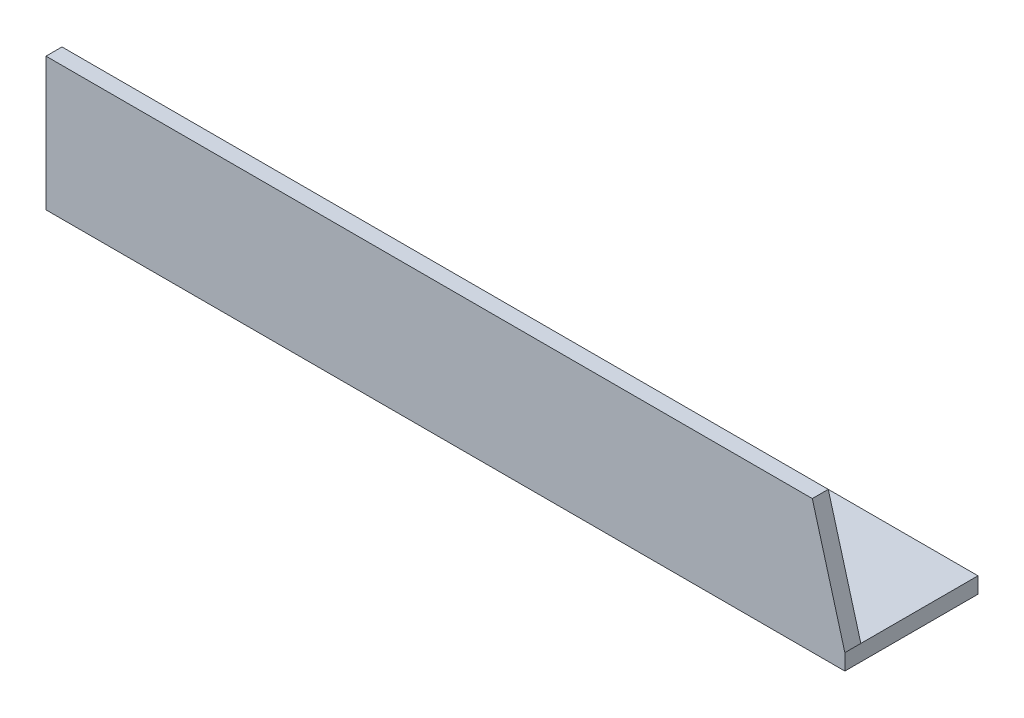
ISO-10303-21;
HEADER;
FILE_DESCRIPTION(('STEP AP214'),'2;1');
FILE_NAME('part.step','',(''),(''),'','','');
FILE_SCHEMA(('AUTOMOTIVE_DESIGN { 1 0 10303 214 1 1 1 1 }'));
ENDSEC;
DATA;
#1=APPLICATION_CONTEXT('core data for automotive mechanical design processes');
#2=APPLICATION_PROTOCOL_DEFINITION('international standard','automotive_design',2000,#1);
#3=PRODUCT_CONTEXT('',#1,'mechanical');
#4=PRODUCT('Part','Part','',(#3));
#5=PRODUCT_RELATED_PRODUCT_CATEGORY('part','',(#4));
#6=PRODUCT_DEFINITION_FORMATION('','',#4);
#7=PRODUCT_DEFINITION_CONTEXT('part definition',#1,'design');
#8=PRODUCT_DEFINITION('design','',#6,#7);
#9=PRODUCT_DEFINITION_SHAPE('','',#8);
#10=(LENGTH_UNIT() NAMED_UNIT(*) SI_UNIT(.MILLI.,.METRE.));
#11=(NAMED_UNIT(*) PLANE_ANGLE_UNIT() SI_UNIT($,.RADIAN.));
#12=(NAMED_UNIT(*) SI_UNIT($,.STERADIAN.) SOLID_ANGLE_UNIT());
#13=UNCERTAINTY_MEASURE_WITH_UNIT(LENGTH_MEASURE(1.E-05),#10,'distance_accuracy_value','');
#14=(GEOMETRIC_REPRESENTATION_CONTEXT(3) GLOBAL_UNCERTAINTY_ASSIGNED_CONTEXT((#13)) GLOBAL_UNIT_ASSIGNED_CONTEXT((#10,
#11,#12)) REPRESENTATION_CONTEXT('',''));
#15=CARTESIAN_POINT('',(0.,0.,0.));
#16=DIRECTION('',(0.,0.,1.));
#17=DIRECTION('',(1.,0.,0.));
#18=AXIS2_PLACEMENT_3D('',#15,#16,#17);
#19=CARTESIAN_POINT('',(300.,0.,0.));
#20=DIRECTION('',(0.,1.,0.));
#21=DIRECTION('',(0.,0.,1.));
#22=AXIS2_PLACEMENT_3D('',#19,#20,#21);
#23=PLANE('',#22);
#24=DIRECTION('',(0.,0.,-1.));
#25=VECTOR('',#24,1.);
#26=CARTESIAN_POINT('',(0.,0.,0.));
#27=LINE('',#26,#25);
#28=CARTESIAN_POINT('',(0.,0.,0.));
#29=VERTEX_POINT('',#28);
#30=CARTESIAN_POINT('',(0.,0.,-50.));
#31=VERTEX_POINT('',#30);
#32=EDGE_CURVE('E130',#29,#31,#27,.T.);
#33=ORIENTED_EDGE('',*,*,#32,.T.);
#34=DIRECTION('',(-1.,0.,0.));
#35=VECTOR('',#34,1.);
#36=CARTESIAN_POINT('',(300.,0.,-50.));
#37=LINE('',#36,#35);
#38=CARTESIAN_POINT('',(300.,0.,-50.));
#39=VERTEX_POINT('',#38);
#40=EDGE_CURVE('E41',#39,#31,#37,.T.);
#41=ORIENTED_EDGE('',*,*,#40,.F.);
#42=DIRECTION('',(0.,0.,-1.));
#43=VECTOR('',#42,1.);
#44=CARTESIAN_POINT('',(300.,0.,0.));
#45=LINE('',#44,#43);
#46=CARTESIAN_POINT('',(300.,0.,0.));
#47=VERTEX_POINT('',#46);
#48=EDGE_CURVE('E85',#47,#39,#45,.T.);
#49=ORIENTED_EDGE('',*,*,#48,.F.);
#50=DIRECTION('',(-1.,0.,0.));
#51=VECTOR('',#50,1.);
#52=CARTESIAN_POINT('',(300.,0.,0.));
#53=LINE('',#52,#51);
#54=EDGE_CURVE('E110',#47,#29,#53,.T.);
#55=ORIENTED_EDGE('',*,*,#54,.T.);
#56=EDGE_LOOP('',(#33,#41,#49,#55));
#57=FACE_BOUND('',#56,.T.);
#58=ADVANCED_FACE('F34',(#57),#23,.F.);
#59=CARTESIAN_POINT('',(300.,6.,-50.));
#60=DIRECTION('',(0.,0.,-1.));
#61=DIRECTION('',(-1.,0.,0.));
#62=AXIS2_PLACEMENT_3D('',#59,#60,#61);
#63=PLANE('',#62);
#64=DIRECTION('',(0.,-1.,0.));
#65=VECTOR('',#64,1.);
#66=CARTESIAN_POINT('',(0.,6.,-50.));
#67=LINE('',#66,#65);
#68=CARTESIAN_POINT('',(0.,6.,-50.));
#69=VERTEX_POINT('',#68);
#70=EDGE_CURVE('E125',#69,#31,#67,.T.);
#71=ORIENTED_EDGE('',*,*,#70,.F.);
#72=DIRECTION('',(-1.,0.,0.));
#73=VECTOR('',#72,1.);
#74=CARTESIAN_POINT('',(300.,6.,-50.));
#75=LINE('',#74,#73);
#76=CARTESIAN_POINT('',(300.,6.,-50.));
#77=VERTEX_POINT('',#76);
#78=EDGE_CURVE('E118',#77,#69,#75,.T.);
#79=ORIENTED_EDGE('',*,*,#78,.F.);
#80=DIRECTION('',(0.,-1.,0.));
#81=VECTOR('',#80,1.);
#82=CARTESIAN_POINT('',(300.,6.,-50.));
#83=LINE('',#82,#81);
#84=EDGE_CURVE('E127',#77,#39,#83,.T.);
#85=ORIENTED_EDGE('',*,*,#84,.T.);
#86=ORIENTED_EDGE('',*,*,#40,.T.);
#87=EDGE_LOOP('',(#71,#79,#85,#86));
#88=FACE_BOUND('',#87,.T.);
#89=ADVANCED_FACE('F123',(#88),#63,.T.);
#90=CARTESIAN_POINT('',(300.,6.,0.));
#91=DIRECTION('',(0.,1.,0.));
#92=DIRECTION('',(0.,0.,1.));
#93=AXIS2_PLACEMENT_3D('',#90,#91,#92);
#94=PLANE('',#93);
#95=DIRECTION('',(0.,0.,-1.));
#96=VECTOR('',#95,1.);
#97=CARTESIAN_POINT('',(0.,6.,0.));
#98=LINE('',#97,#96);
#99=CARTESIAN_POINT('',(0.,6.,-6.));
#100=VERTEX_POINT('',#99);
#101=EDGE_CURVE('E136',#100,#69,#98,.T.);
#102=ORIENTED_EDGE('',*,*,#101,.F.);
#103=DIRECTION('',(-1.,0.,0.));
#104=VECTOR('',#103,1.);
#105=CARTESIAN_POINT('',(300.,6.,-6.));
#106=LINE('',#105,#104);
#107=CARTESIAN_POINT('',(300.,5.99999999999955,-6.));
#108=VERTEX_POINT('',#107);
#109=EDGE_CURVE('E112',#108,#100,#106,.T.);
#110=ORIENTED_EDGE('',*,*,#109,.F.);
#111=DIRECTION('',(0.,0.,-1.));
#112=VECTOR('',#111,1.);
#113=CARTESIAN_POINT('',(300.,6.,0.));
#114=LINE('',#113,#112);
#115=EDGE_CURVE('E144',#108,#77,#114,.T.);
#116=ORIENTED_EDGE('',*,*,#115,.T.);
#117=ORIENTED_EDGE('',*,*,#78,.T.);
#118=EDGE_LOOP('',(#102,#110,#116,#117));
#119=FACE_BOUND('',#118,.T.);
#120=ADVANCED_FACE('F152',(#119),#94,.T.);
#121=CARTESIAN_POINT('',(300.,50.,-6.));
#122=DIRECTION('',(0.,0.,-1.));
#123=DIRECTION('',(0.,1.,0.));
#124=AXIS2_PLACEMENT_3D('',#121,#122,#123);
#125=PLANE('',#124);
#126=DIRECTION('',(-0.267730580984119,0.96349381731587,0.));
#127=VECTOR('',#126,1.);
#128=CARTESIAN_POINT('',(288.649902582678,46.8460947842598,-6.));
#129=LINE('',#128,#127);
#130=CARTESIAN_POINT('',(287.773512033405,50.,-6.));
#131=VERTEX_POINT('',#130);
#132=EDGE_CURVE('E97',#108,#131,#129,.T.);
#133=ORIENTED_EDGE('',*,*,#132,.F.);
#134=ORIENTED_EDGE('',*,*,#109,.T.);
#135=DIRECTION('',(0.,-1.,0.));
#136=VECTOR('',#135,1.);
#137=CARTESIAN_POINT('',(0.,50.,-6.));
#138=LINE('',#137,#136);
#139=CARTESIAN_POINT('',(0.,50.,-6.));
#140=VERTEX_POINT('',#139);
#141=EDGE_CURVE('E138',#140,#100,#138,.T.);
#142=ORIENTED_EDGE('',*,*,#141,.F.);
#143=DIRECTION('',(-1.,0.,0.));
#144=VECTOR('',#143,1.);
#145=CARTESIAN_POINT('',(300.,50.,-6.));
#146=LINE('',#145,#144);
#147=EDGE_CURVE('E109',#131,#140,#146,.T.);
#148=ORIENTED_EDGE('',*,*,#147,.F.);
#149=EDGE_LOOP('',(#133,#134,#142,#148));
#150=FACE_BOUND('',#149,.T.);
#151=ADVANCED_FACE('F155',(#150),#125,.T.);
#152=CARTESIAN_POINT('',(300.,50.,0.));
#153=DIRECTION('',(0.,1.,0.));
#154=DIRECTION('',(0.,0.,1.));
#155=AXIS2_PLACEMENT_3D('',#152,#153,#154);
#156=PLANE('',#155);
#157=DIRECTION('',(0.,0.,1.));
#158=VECTOR('',#157,1.);
#159=CARTESIAN_POINT('',(287.773512033405,50.,-50.));
#160=LINE('',#159,#158);
#161=CARTESIAN_POINT('',(287.773512033405,50.,0.));
#162=VERTEX_POINT('',#161);
#163=EDGE_CURVE('E94',#131,#162,#160,.T.);
#164=ORIENTED_EDGE('',*,*,#163,.F.);
#165=ORIENTED_EDGE('',*,*,#147,.T.);
#166=DIRECTION('',(0.,0.,-1.));
#167=VECTOR('',#166,1.);
#168=CARTESIAN_POINT('',(0.,50.,0.));
#169=LINE('',#168,#167);
#170=CARTESIAN_POINT('',(0.,50.,0.));
#171=VERTEX_POINT('',#170);
#172=EDGE_CURVE('E108',#171,#140,#169,.T.);
#173=ORIENTED_EDGE('',*,*,#172,.F.);
#174=DIRECTION('',(-1.,0.,0.));
#175=VECTOR('',#174,1.);
#176=CARTESIAN_POINT('',(300.,50.,0.));
#177=LINE('',#176,#175);
#178=EDGE_CURVE('E103',#162,#171,#177,.T.);
#179=ORIENTED_EDGE('',*,*,#178,.F.);
#180=EDGE_LOOP('',(#164,#165,#173,#179));
#181=FACE_BOUND('',#180,.T.);
#182=ADVANCED_FACE('F106',(#181),#156,.T.);
#183=CARTESIAN_POINT('',(300.,50.,0.));
#184=DIRECTION('',(0.,0.,-1.));
#185=DIRECTION('',(0.,1.,0.));
#186=AXIS2_PLACEMENT_3D('',#183,#184,#185);
#187=PLANE('',#186);
#188=DIRECTION('',(0.,-1.,0.));
#189=VECTOR('',#188,1.);
#190=CARTESIAN_POINT('',(300.,50.,0.));
#191=LINE('',#190,#189);
#192=CARTESIAN_POINT('',(300.,5.99999999999955,0.));
#193=VERTEX_POINT('',#192);
#194=EDGE_CURVE('E55',#193,#47,#191,.T.);
#195=ORIENTED_EDGE('',*,*,#194,.F.);
#196=DIRECTION('',(0.267730580984119,-0.963493817315869,0.));
#197=VECTOR('',#196,1.);
#198=CARTESIAN_POINT('',(300.,5.99999999999955,0.));
#199=LINE('',#198,#197);
#200=EDGE_CURVE('E48',#162,#193,#199,.T.);
#201=ORIENTED_EDGE('',*,*,#200,.F.);
#202=ORIENTED_EDGE('',*,*,#178,.T.);
#203=DIRECTION('',(0.,-1.,0.));
#204=VECTOR('',#203,1.);
#205=CARTESIAN_POINT('',(0.,50.,0.));
#206=LINE('',#205,#204);
#207=EDGE_CURVE('E81',#171,#29,#206,.T.);
#208=ORIENTED_EDGE('',*,*,#207,.T.);
#209=ORIENTED_EDGE('',*,*,#54,.F.);
#210=EDGE_LOOP('',(#195,#201,#202,#208,#209));
#211=FACE_BOUND('',#210,.T.);
#212=ADVANCED_FACE('F102',(#211),#187,.F.);
#213=CARTESIAN_POINT('',(300.,0.,0.));
#214=DIRECTION('',(-1.,0.,0.));
#215=DIRECTION('',(0.,0.,1.));
#216=AXIS2_PLACEMENT_3D('',#213,#214,#215);
#217=PLANE('',#216);
#218=ORIENTED_EDGE('',*,*,#115,.F.);
#219=DIRECTION('',(0.,0.,1.));
#220=VECTOR('',#219,1.);
#221=CARTESIAN_POINT('',(300.,5.99999999999955,0.));
#222=LINE('',#221,#220);
#223=EDGE_CURVE('E11',#108,#193,#222,.T.);
#224=ORIENTED_EDGE('',*,*,#223,.T.);
#225=ORIENTED_EDGE('',*,*,#194,.T.);
#226=ORIENTED_EDGE('',*,*,#48,.T.);
#227=ORIENTED_EDGE('',*,*,#84,.F.);
#228=EDGE_LOOP('',(#218,#224,#225,#226,#227));
#229=FACE_BOUND('',#228,.T.);
#230=ADVANCED_FACE('F153',(#229),#217,.F.);
#231=CARTESIAN_POINT('',(0.,0.,0.));
#232=DIRECTION('',(-1.,0.,0.));
#233=DIRECTION('',(0.,0.,1.));
#234=AXIS2_PLACEMENT_3D('',#231,#232,#233);
#235=PLANE('',#234);
#236=ORIENTED_EDGE('',*,*,#32,.F.);
#237=ORIENTED_EDGE('',*,*,#207,.F.);
#238=ORIENTED_EDGE('',*,*,#172,.T.);
#239=ORIENTED_EDGE('',*,*,#141,.T.);
#240=ORIENTED_EDGE('',*,*,#101,.T.);
#241=ORIENTED_EDGE('',*,*,#70,.T.);
#242=EDGE_LOOP('',(#236,#237,#238,#239,#240,#241));
#243=FACE_BOUND('',#242,.T.);
#244=ADVANCED_FACE('F133',(#243),#235,.T.);
#245=CARTESIAN_POINT('',(300.,5.99999999999955,-50.));
#246=DIRECTION('',(-0.96349381731587,-0.267730580984119,0.));
#247=DIRECTION('',(0.267730580984119,-0.96349381731587,0.));
#248=AXIS2_PLACEMENT_3D('',#245,#246,#247);
#249=PLANE('',#248);
#250=ORIENTED_EDGE('',*,*,#132,.T.);
#251=ORIENTED_EDGE('',*,*,#163,.T.);
#252=ORIENTED_EDGE('',*,*,#200,.T.);
#253=ORIENTED_EDGE('',*,*,#223,.F.);
#254=EDGE_LOOP('',(#250,#251,#252,#253));
#255=FACE_BOUND('',#254,.T.);
#256=ADVANCED_FACE('F95',(#255),#249,.F.);
#257=CLOSED_SHELL('',(#58,#89,#120,#151,#182,#212,#230,#244,#256));
#258=MANIFOLD_SOLID_BREP('B2',#257);
#259=ADVANCED_BREP_SHAPE_REPRESENTATION('',(#18,#258),#14);
#260=SHAPE_DEFINITION_REPRESENTATION(#9,#259);
ENDSEC;
END-ISO-10303-21;
